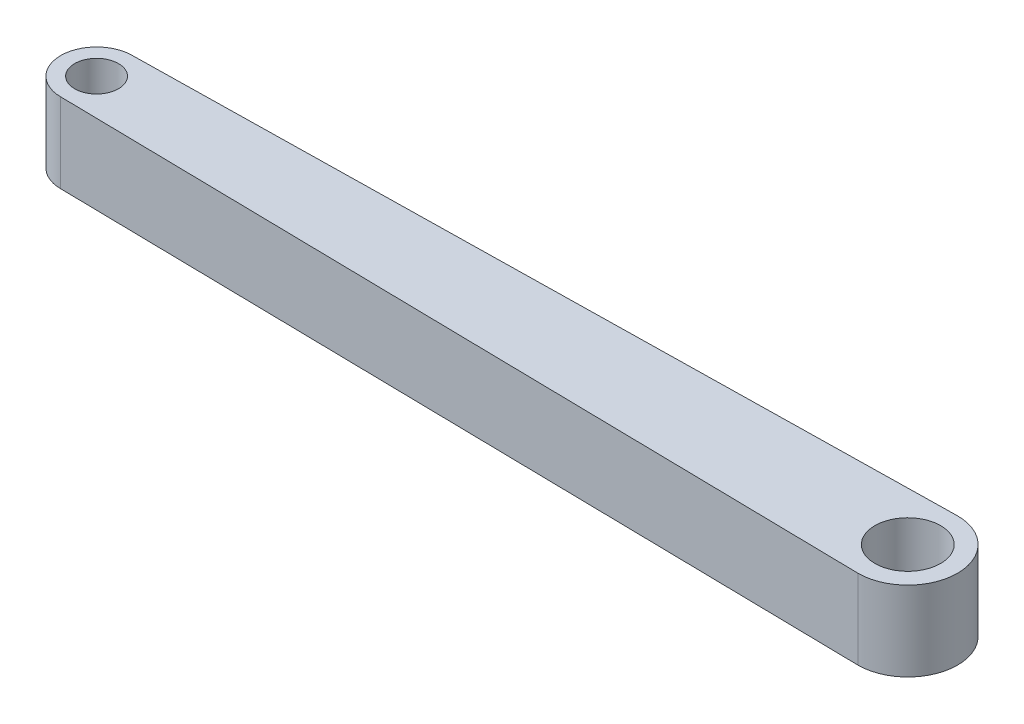
ISO-10303-21;
HEADER;
FILE_DESCRIPTION(('STEP AP214'),'2;1');
FILE_NAME('part.step','',(''),(''),'','','');
FILE_SCHEMA(('AUTOMOTIVE_DESIGN { 1 0 10303 214 1 1 1 1 }'));
ENDSEC;
DATA;
#1=APPLICATION_CONTEXT('core data for automotive mechanical design processes');
#2=APPLICATION_PROTOCOL_DEFINITION('international standard','automotive_design',2000,#1);
#3=PRODUCT_CONTEXT('',#1,'mechanical');
#4=PRODUCT('Part','Part','',(#3));
#5=PRODUCT_RELATED_PRODUCT_CATEGORY('part','',(#4));
#6=PRODUCT_DEFINITION_FORMATION('','',#4);
#7=PRODUCT_DEFINITION_CONTEXT('part definition',#1,'design');
#8=PRODUCT_DEFINITION('design','',#6,#7);
#9=PRODUCT_DEFINITION_SHAPE('','',#8);
#10=(LENGTH_UNIT() NAMED_UNIT(*) SI_UNIT(.MILLI.,.METRE.));
#11=(NAMED_UNIT(*) PLANE_ANGLE_UNIT() SI_UNIT($,.RADIAN.));
#12=(NAMED_UNIT(*) SI_UNIT($,.STERADIAN.) SOLID_ANGLE_UNIT());
#13=UNCERTAINTY_MEASURE_WITH_UNIT(LENGTH_MEASURE(1.E-05),#10,'distance_accuracy_value','');
#14=(GEOMETRIC_REPRESENTATION_CONTEXT(3) GLOBAL_UNCERTAINTY_ASSIGNED_CONTEXT((#13)) GLOBAL_UNIT_ASSIGNED_CONTEXT((#10,
#11,#12)) REPRESENTATION_CONTEXT('',''));
#15=CARTESIAN_POINT('',(0.,0.,0.));
#16=DIRECTION('',(0.,0.,1.));
#17=DIRECTION('',(1.,0.,0.));
#18=AXIS2_PLACEMENT_3D('',#15,#16,#17);
#19=CARTESIAN_POINT('',(-0.0184562837617146,2.,1.07468303732499));
#20=DIRECTION('',(0.0171711676948472,0.,-0.999852564631404));
#21=DIRECTION('',(-0.999852564631404,0.,-0.0171711676948472));
#22=AXIS2_PLACEMENT_3D('',#19,#20,#21);
#23=PLANE('',#22);
#24=DIRECTION('',(0.999852564631404,0.,0.0171711676948472));
#25=VECTOR('',#24,1.);
#26=CARTESIAN_POINT('',(-0.0184562837617146,0.,1.07468303732499));
#27=LINE('',#26,#25);
#28=CARTESIAN_POINT('',(-10.19,0.,0.9));
#29=VERTEX_POINT('',#28);
#30=CARTESIAN_POINT('',(10.19,0.,1.25));
#31=VERTEX_POINT('',#30);
#32=EDGE_CURVE('E110',#29,#31,#27,.T.);
#33=ORIENTED_EDGE('',*,*,#32,.T.);
#34=DIRECTION('',(0.,-1.,0.));
#35=VECTOR('',#34,1.);
#36=CARTESIAN_POINT('',(10.19,2.,1.25));
#37=LINE('',#36,#35);
#38=CARTESIAN_POINT('',(10.19,2.,1.25));
#39=VERTEX_POINT('',#38);
#40=EDGE_CURVE('E11',#39,#31,#37,.T.);
#41=ORIENTED_EDGE('',*,*,#40,.F.);
#42=DIRECTION('',(0.999852564631404,0.,0.0171711676948472));
#43=VECTOR('',#42,1.);
#44=CARTESIAN_POINT('',(-0.0184562837617146,2.,1.07468303732499));
#45=LINE('',#44,#43);
#46=CARTESIAN_POINT('',(-10.19,2.,0.9));
#47=VERTEX_POINT('',#46);
#48=EDGE_CURVE('E89',#47,#39,#45,.T.);
#49=ORIENTED_EDGE('',*,*,#48,.F.);
#50=DIRECTION('',(0.,-1.,0.));
#51=VECTOR('',#50,1.);
#52=CARTESIAN_POINT('',(-10.19,2.,0.9));
#53=LINE('',#52,#51);
#54=EDGE_CURVE('E100',#47,#29,#53,.T.);
#55=ORIENTED_EDGE('',*,*,#54,.T.);
#56=EDGE_LOOP('',(#33,#41,#49,#55));
#57=FACE_BOUND('',#56,.T.);
#58=ADVANCED_FACE('F41',(#57),#23,.F.);
#59=CARTESIAN_POINT('',(10.19,2.,0.));
#60=DIRECTION('',(0.,-1.,0.));
#61=DIRECTION('',(0.,0.,-1.));
#62=AXIS2_PLACEMENT_3D('',#59,#60,#61);
#63=CYLINDRICAL_SURFACE('',#62,1.25);
#64=CARTESIAN_POINT('',(10.19,0.,0.));
#65=DIRECTION('',(0.,1.,0.));
#66=DIRECTION('',(0.,0.,1.));
#67=AXIS2_PLACEMENT_3D('',#64,#65,#66);
#68=CIRCLE('',#67,1.25);
#69=CARTESIAN_POINT('',(10.19,0.,-1.25));
#70=VERTEX_POINT('',#69);
#71=EDGE_CURVE('E94',#31,#70,#68,.T.);
#72=ORIENTED_EDGE('',*,*,#71,.T.);
#73=DIRECTION('',(0.,-1.,0.));
#74=VECTOR('',#73,1.);
#75=CARTESIAN_POINT('',(10.19,2.,-1.25));
#76=LINE('',#75,#74);
#77=CARTESIAN_POINT('',(10.19,2.,-1.25));
#78=VERTEX_POINT('',#77);
#79=EDGE_CURVE('E50',#78,#70,#76,.T.);
#80=ORIENTED_EDGE('',*,*,#79,.F.);
#81=CARTESIAN_POINT('',(10.19,2.,0.));
#82=DIRECTION('',(0.,1.,0.));
#83=DIRECTION('',(0.,0.,1.));
#84=AXIS2_PLACEMENT_3D('',#81,#82,#83);
#85=CIRCLE('',#84,1.25);
#86=EDGE_CURVE('E84',#39,#78,#85,.T.);
#87=ORIENTED_EDGE('',*,*,#86,.F.);
#88=ORIENTED_EDGE('',*,*,#40,.T.);
#89=EDGE_LOOP('',(#72,#80,#87,#88));
#90=FACE_BOUND('',#89,.T.);
#91=ADVANCED_FACE('F93',(#90),#63,.T.);
#92=CARTESIAN_POINT('',(-0.018456283761715,2.,-1.074683037325));
#93=DIRECTION('',(-0.0171711676948476,0.,-0.999852564631404));
#94=DIRECTION('',(-0.999852564631404,0.,0.0171711676948476));
#95=AXIS2_PLACEMENT_3D('',#92,#93,#94);
#96=PLANE('',#95);
#97=DIRECTION('',(0.999852564631404,0.,-0.0171711676948476));
#98=VECTOR('',#97,1.);
#99=CARTESIAN_POINT('',(-0.018456283761715,0.,-1.074683037325));
#100=LINE('',#99,#98);
#101=CARTESIAN_POINT('',(-10.19,0.,-0.9));
#102=VERTEX_POINT('',#101);
#103=EDGE_CURVE('E114',#102,#70,#100,.T.);
#104=ORIENTED_EDGE('',*,*,#103,.F.);
#105=DIRECTION('',(0.,-1.,0.));
#106=VECTOR('',#105,1.);
#107=CARTESIAN_POINT('',(-10.19,2.,-0.9));
#108=LINE('',#107,#106);
#109=CARTESIAN_POINT('',(-10.19,2.,-0.9));
#110=VERTEX_POINT('',#109);
#111=EDGE_CURVE('E74',#110,#102,#108,.T.);
#112=ORIENTED_EDGE('',*,*,#111,.F.);
#113=DIRECTION('',(0.999852564631404,0.,-0.0171711676948476));
#114=VECTOR('',#113,1.);
#115=CARTESIAN_POINT('',(-0.018456283761715,2.,-1.074683037325));
#116=LINE('',#115,#114);
#117=EDGE_CURVE('E87',#110,#78,#116,.T.);
#118=ORIENTED_EDGE('',*,*,#117,.T.);
#119=ORIENTED_EDGE('',*,*,#79,.T.);
#120=EDGE_LOOP('',(#104,#112,#118,#119));
#121=FACE_BOUND('',#120,.T.);
#122=ADVANCED_FACE('F98',(#121),#96,.T.);
#123=CARTESIAN_POINT('',(-10.19,2.,0.));
#124=DIRECTION('',(0.,-1.,0.));
#125=DIRECTION('',(0.,0.,-1.));
#126=AXIS2_PLACEMENT_3D('',#123,#124,#125);
#127=CYLINDRICAL_SURFACE('',#126,0.55);
#128=CARTESIAN_POINT('',(-10.19,2.,0.));
#129=DIRECTION('',(0.,1.,0.));
#130=DIRECTION('',(0.,0.,1.));
#131=AXIS2_PLACEMENT_3D('',#128,#129,#130);
#132=CIRCLE('',#131,0.55);
#133=CARTESIAN_POINT('',(-10.19,2.,0.55));
#134=VERTEX_POINT('',#133);
#135=EDGE_CURVE('E152',#134,#134,#132,.T.);
#136=ORIENTED_EDGE('',*,*,#135,.T.);
#137=EDGE_LOOP('',(#136));
#138=FACE_BOUND('',#137,.T.);
#139=CARTESIAN_POINT('',(-10.19,0.,0.));
#140=DIRECTION('',(0.,1.,0.));
#141=DIRECTION('',(0.,0.,1.));
#142=AXIS2_PLACEMENT_3D('',#139,#140,#141);
#143=CIRCLE('',#142,0.55);
#144=CARTESIAN_POINT('',(-10.19,0.,0.55));
#145=VERTEX_POINT('',#144);
#146=EDGE_CURVE('E107',#145,#145,#143,.T.);
#147=ORIENTED_EDGE('',*,*,#146,.F.);
#148=EDGE_LOOP('',(#147));
#149=FACE_BOUND('',#148,.T.);
#150=ADVANCED_FACE('F141',(#138,#149),#127,.F.);
#151=CARTESIAN_POINT('',(10.19,2.,0.));
#152=DIRECTION('',(0.,-1.,0.));
#153=DIRECTION('',(0.,0.,-1.));
#154=AXIS2_PLACEMENT_3D('',#151,#152,#153);
#155=CYLINDRICAL_SURFACE('',#154,0.824999999999999);
#156=CARTESIAN_POINT('',(10.19,2.,0.));
#157=DIRECTION('',(0.,1.,0.));
#158=DIRECTION('',(0.,0.,1.));
#159=AXIS2_PLACEMENT_3D('',#156,#157,#158);
#160=CIRCLE('',#159,0.824999999999999);
#161=CARTESIAN_POINT('',(10.19,2.,0.824999999999996));
#162=VERTEX_POINT('',#161);
#163=EDGE_CURVE('E117',#162,#162,#160,.T.);
#164=ORIENTED_EDGE('',*,*,#163,.T.);
#165=EDGE_LOOP('',(#164));
#166=FACE_BOUND('',#165,.T.);
#167=CARTESIAN_POINT('',(10.19,0.,0.));
#168=DIRECTION('',(0.,1.,0.));
#169=DIRECTION('',(0.,0.,1.));
#170=AXIS2_PLACEMENT_3D('',#167,#168,#169);
#171=CIRCLE('',#170,0.824999999999999);
#172=CARTESIAN_POINT('',(10.19,0.,0.824999999999996));
#173=VERTEX_POINT('',#172);
#174=EDGE_CURVE('E104',#173,#173,#171,.T.);
#175=ORIENTED_EDGE('',*,*,#174,.F.);
#176=EDGE_LOOP('',(#175));
#177=FACE_BOUND('',#176,.T.);
#178=ADVANCED_FACE('F43',(#166,#177),#155,.F.);
#179=CARTESIAN_POINT('',(-10.19,2.,0.));
#180=DIRECTION('',(0.,-1.,0.));
#181=DIRECTION('',(0.,0.,-1.));
#182=AXIS2_PLACEMENT_3D('',#179,#180,#181);
#183=CYLINDRICAL_SURFACE('',#182,0.9);
#184=CARTESIAN_POINT('',(-10.19,0.,0.));
#185=DIRECTION('',(0.,1.,0.));
#186=DIRECTION('',(0.,0.,1.));
#187=AXIS2_PLACEMENT_3D('',#184,#185,#186);
#188=CIRCLE('',#187,0.9);
#189=EDGE_CURVE('E77',#102,#29,#188,.T.);
#190=ORIENTED_EDGE('',*,*,#189,.T.);
#191=ORIENTED_EDGE('',*,*,#54,.F.);
#192=CARTESIAN_POINT('',(-10.19,2.,0.));
#193=DIRECTION('',(0.,1.,0.));
#194=DIRECTION('',(0.,0.,1.));
#195=AXIS2_PLACEMENT_3D('',#192,#193,#194);
#196=CIRCLE('',#195,0.9);
#197=EDGE_CURVE('E58',#110,#47,#196,.T.);
#198=ORIENTED_EDGE('',*,*,#197,.F.);
#199=ORIENTED_EDGE('',*,*,#111,.T.);
#200=EDGE_LOOP('',(#190,#191,#198,#199));
#201=FACE_BOUND('',#200,.T.);
#202=ADVANCED_FACE('F129',(#201),#183,.T.);
#203=CARTESIAN_POINT('',(0.,2.,0.));
#204=DIRECTION('',(0.,1.,0.));
#205=DIRECTION('',(0.,0.,1.));
#206=AXIS2_PLACEMENT_3D('',#203,#204,#205);
#207=PLANE('',#206);
#208=ORIENTED_EDGE('',*,*,#163,.F.);
#209=EDGE_LOOP('',(#208));
#210=FACE_BOUND('',#209,.T.);
#211=ORIENTED_EDGE('',*,*,#135,.F.);
#212=EDGE_LOOP('',(#211));
#213=FACE_BOUND('',#212,.T.);
#214=ORIENTED_EDGE('',*,*,#48,.T.);
#215=ORIENTED_EDGE('',*,*,#86,.T.);
#216=ORIENTED_EDGE('',*,*,#117,.F.);
#217=ORIENTED_EDGE('',*,*,#197,.T.);
#218=EDGE_LOOP('',(#214,#215,#216,#217));
#219=FACE_BOUND('',#218,.T.);
#220=ADVANCED_FACE('F85',(#210,#213,#219),#207,.T.);
#221=CARTESIAN_POINT('',(0.,0.,0.));
#222=DIRECTION('',(0.,1.,0.));
#223=DIRECTION('',(0.,0.,1.));
#224=AXIS2_PLACEMENT_3D('',#221,#222,#223);
#225=PLANE('',#224);
#226=ORIENTED_EDGE('',*,*,#174,.T.);
#227=EDGE_LOOP('',(#226));
#228=FACE_BOUND('',#227,.T.);
#229=ORIENTED_EDGE('',*,*,#146,.T.);
#230=EDGE_LOOP('',(#229));
#231=FACE_BOUND('',#230,.T.);
#232=ORIENTED_EDGE('',*,*,#32,.F.);
#233=ORIENTED_EDGE('',*,*,#189,.F.);
#234=ORIENTED_EDGE('',*,*,#103,.T.);
#235=ORIENTED_EDGE('',*,*,#71,.F.);
#236=EDGE_LOOP('',(#232,#233,#234,#235));
#237=FACE_BOUND('',#236,.T.);
#238=ADVANCED_FACE('F122',(#228,#231,#237),#225,.F.);
#239=CLOSED_SHELL('',(#58,#91,#122,#150,#178,#202,#220,#238));
#240=MANIFOLD_SOLID_BREP('B2',#239);
#241=ADVANCED_BREP_SHAPE_REPRESENTATION('',(#18,#240),#14);
#242=SHAPE_DEFINITION_REPRESENTATION(#9,#241);
ENDSEC;
END-ISO-10303-21;
